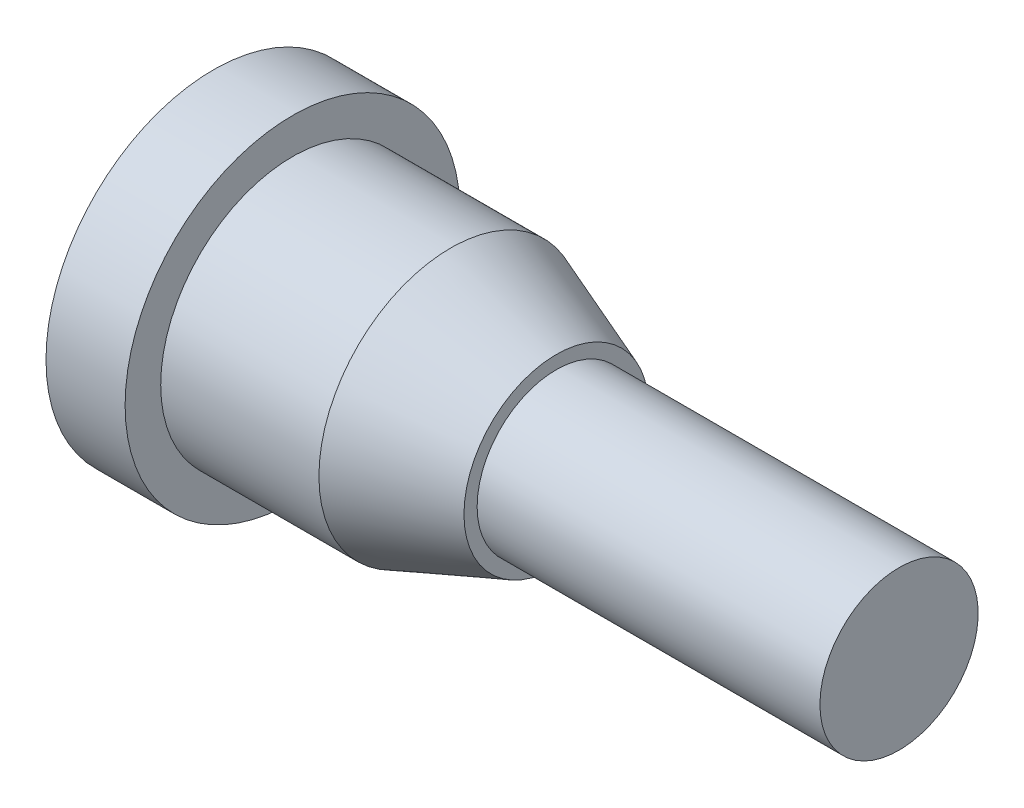
ISO-10303-21;
HEADER;
FILE_DESCRIPTION(('STEP AP214'),'2;1');
FILE_NAME('part.step','',(''),(''),'','','');
FILE_SCHEMA(('AUTOMOTIVE_DESIGN { 1 0 10303 214 1 1 1 1 }'));
ENDSEC;
DATA;
#1=APPLICATION_CONTEXT('core data for automotive mechanical design processes');
#2=APPLICATION_PROTOCOL_DEFINITION('international standard','automotive_design',2000,#1);
#3=PRODUCT_CONTEXT('',#1,'mechanical');
#4=PRODUCT('Part','Part','',(#3));
#5=PRODUCT_RELATED_PRODUCT_CATEGORY('part','',(#4));
#6=PRODUCT_DEFINITION_FORMATION('','',#4);
#7=PRODUCT_DEFINITION_CONTEXT('part definition',#1,'design');
#8=PRODUCT_DEFINITION('design','',#6,#7);
#9=PRODUCT_DEFINITION_SHAPE('','',#8);
#10=(LENGTH_UNIT() NAMED_UNIT(*) SI_UNIT(.MILLI.,.METRE.));
#11=(NAMED_UNIT(*) PLANE_ANGLE_UNIT() SI_UNIT($,.RADIAN.));
#12=(NAMED_UNIT(*) SI_UNIT($,.STERADIAN.) SOLID_ANGLE_UNIT());
#13=UNCERTAINTY_MEASURE_WITH_UNIT(LENGTH_MEASURE(1.E-05),#10,'distance_accuracy_value','');
#14=(GEOMETRIC_REPRESENTATION_CONTEXT(3) GLOBAL_UNCERTAINTY_ASSIGNED_CONTEXT((#13)) GLOBAL_UNIT_ASSIGNED_CONTEXT((#10,
#11,#12)) REPRESENTATION_CONTEXT('',''));
#15=CARTESIAN_POINT('',(0.,0.,0.));
#16=DIRECTION('',(0.,0.,1.));
#17=DIRECTION('',(1.,0.,0.));
#18=AXIS2_PLACEMENT_3D('',#15,#16,#17);
#19=CARTESIAN_POINT('',(0.,0.,0.));
#20=DIRECTION('',(1.,0.,0.));
#21=DIRECTION('',(0.,0.,-1.));
#22=AXIS2_PLACEMENT_3D('',#19,#20,#21);
#23=PLANE('',#22);
#24=CARTESIAN_POINT('',(0.,0.,0.));
#25=DIRECTION('',(-1.,0.,0.));
#26=DIRECTION('',(0.,0.,1.));
#27=AXIS2_PLACEMENT_3D('',#24,#25,#26);
#28=CIRCLE('',#27,6.35);
#29=CARTESIAN_POINT('',(0.,0.,6.35));
#30=VERTEX_POINT('',#29);
#31=EDGE_CURVE('E10',#30,#30,#28,.T.);
#32=ORIENTED_EDGE('',*,*,#31,.T.);
#33=EDGE_LOOP('',(#32));
#34=FACE_BOUND('',#33,.T.);
#35=ADVANCED_FACE('F29',(#34),#23,.F.);
#36=CARTESIAN_POINT('',(-5.03245699579391,0.,0.));
#37=DIRECTION('',(-1.,0.,0.));
#38=DIRECTION('',(0.,0.,1.));
#39=AXIS2_PLACEMENT_3D('',#36,#37,#38);
#40=CYLINDRICAL_SURFACE('',#39,6.35);
#41=ORIENTED_EDGE('',*,*,#31,.F.);
#42=EDGE_LOOP('',(#41));
#43=FACE_BOUND('',#42,.T.);
#44=CARTESIAN_POINT('',(3.,0.,0.));
#45=DIRECTION('',(-1.,0.,0.));
#46=DIRECTION('',(0.,0.,1.));
#47=AXIS2_PLACEMENT_3D('',#44,#45,#46);
#48=CIRCLE('',#47,6.35);
#49=CARTESIAN_POINT('',(3.,0.,6.35));
#50=VERTEX_POINT('',#49);
#51=EDGE_CURVE('E35',#50,#50,#48,.T.);
#52=ORIENTED_EDGE('',*,*,#51,.T.);
#53=EDGE_LOOP('',(#52));
#54=FACE_BOUND('',#53,.T.);
#55=ADVANCED_FACE('F70',(#43,#54),#40,.T.);
#56=CARTESIAN_POINT('',(3.,6.35,0.));
#57=DIRECTION('',(-1.,0.,0.));
#58=DIRECTION('',(0.,0.,1.));
#59=AXIS2_PLACEMENT_3D('',#56,#57,#58);
#60=PLANE('',#59);
#61=ORIENTED_EDGE('',*,*,#51,.F.);
#62=EDGE_LOOP('',(#61));
#63=FACE_BOUND('',#62,.T.);
#64=CARTESIAN_POINT('',(3.,0.,0.));
#65=DIRECTION('',(-1.,0.,0.));
#66=DIRECTION('',(0.,0.,1.));
#67=AXIS2_PLACEMENT_3D('',#64,#65,#66);
#68=CIRCLE('',#67,5.);
#69=CARTESIAN_POINT('',(3.,0.,5.));
#70=VERTEX_POINT('',#69);
#71=EDGE_CURVE('E39',#70,#70,#68,.T.);
#72=ORIENTED_EDGE('',*,*,#71,.T.);
#73=EDGE_LOOP('',(#72));
#74=FACE_BOUND('',#73,.T.);
#75=ADVANCED_FACE('F74',(#63,#74),#60,.F.);
#76=CARTESIAN_POINT('',(-5.03245699579391,0.,0.));
#77=DIRECTION('',(-1.,0.,0.));
#78=DIRECTION('',(0.,0.,1.));
#79=AXIS2_PLACEMENT_3D('',#76,#77,#78);
#80=CYLINDRICAL_SURFACE('',#79,5.);
#81=ORIENTED_EDGE('',*,*,#71,.F.);
#82=EDGE_LOOP('',(#81));
#83=FACE_BOUND('',#82,.T.);
#84=CARTESIAN_POINT('',(9.,0.,0.));
#85=DIRECTION('',(-1.,0.,0.));
#86=DIRECTION('',(0.,0.,1.));
#87=AXIS2_PLACEMENT_3D('',#84,#85,#86);
#88=CIRCLE('',#87,5.);
#89=CARTESIAN_POINT('',(9.,0.,5.));
#90=VERTEX_POINT('',#89);
#91=EDGE_CURVE('E43',#90,#90,#88,.T.);
#92=ORIENTED_EDGE('',*,*,#91,.T.);
#93=EDGE_LOOP('',(#92));
#94=FACE_BOUND('',#93,.T.);
#95=ADVANCED_FACE('F79',(#83,#94),#80,.T.);
#96=CARTESIAN_POINT('',(13.,0.,0.));
#97=DIRECTION('',(-1.,0.,0.));
#98=DIRECTION('',(0.,0.,1.));
#99=AXIS2_PLACEMENT_3D('',#96,#97,#98);
#100=CONICAL_SURFACE('',#99,3.5,0.358770670270572);
#101=ORIENTED_EDGE('',*,*,#91,.F.);
#102=EDGE_LOOP('',(#101));
#103=FACE_BOUND('',#102,.T.);
#104=CARTESIAN_POINT('',(13.,0.,0.));
#105=DIRECTION('',(-1.,0.,0.));
#106=DIRECTION('',(0.,0.,1.));
#107=AXIS2_PLACEMENT_3D('',#104,#105,#106);
#108=CIRCLE('',#107,3.5);
#109=CARTESIAN_POINT('',(13.,0.,3.5));
#110=VERTEX_POINT('',#109);
#111=EDGE_CURVE('E48',#110,#110,#108,.T.);
#112=ORIENTED_EDGE('',*,*,#111,.T.);
#113=EDGE_LOOP('',(#112));
#114=FACE_BOUND('',#113,.T.);
#115=ADVANCED_FACE('F85',(#103,#114),#100,.T.);
#116=CARTESIAN_POINT('',(13.,3.5,0.));
#117=DIRECTION('',(-1.,0.,0.));
#118=DIRECTION('',(0.,0.,1.));
#119=AXIS2_PLACEMENT_3D('',#116,#117,#118);
#120=PLANE('',#119);
#121=ORIENTED_EDGE('',*,*,#111,.F.);
#122=EDGE_LOOP('',(#121));
#123=FACE_BOUND('',#122,.T.);
#124=CARTESIAN_POINT('',(13.,0.,0.));
#125=DIRECTION('',(-1.,0.,0.));
#126=DIRECTION('',(0.,0.,1.));
#127=AXIS2_PLACEMENT_3D('',#124,#125,#126);
#128=CIRCLE('',#127,3.);
#129=CARTESIAN_POINT('',(13.,0.,3.));
#130=VERTEX_POINT('',#129);
#131=EDGE_CURVE('E51',#130,#130,#128,.T.);
#132=ORIENTED_EDGE('',*,*,#131,.T.);
#133=EDGE_LOOP('',(#132));
#134=FACE_BOUND('',#133,.T.);
#135=ADVANCED_FACE('F66',(#123,#134),#120,.F.);
#136=CARTESIAN_POINT('',(-5.03245699579391,0.,0.));
#137=DIRECTION('',(-1.,0.,0.));
#138=DIRECTION('',(0.,0.,1.));
#139=AXIS2_PLACEMENT_3D('',#136,#137,#138);
#140=CYLINDRICAL_SURFACE('',#139,3.);
#141=ORIENTED_EDGE('',*,*,#131,.F.);
#142=EDGE_LOOP('',(#141));
#143=FACE_BOUND('',#142,.T.);
#144=CARTESIAN_POINT('',(26.,0.,0.));
#145=DIRECTION('',(-1.,0.,0.));
#146=DIRECTION('',(0.,0.,1.));
#147=AXIS2_PLACEMENT_3D('',#144,#145,#146);
#148=CIRCLE('',#147,3.);
#149=CARTESIAN_POINT('',(26.,0.,3.));
#150=VERTEX_POINT('',#149);
#151=EDGE_CURVE('E54',#150,#150,#148,.T.);
#152=ORIENTED_EDGE('',*,*,#151,.T.);
#153=EDGE_LOOP('',(#152));
#154=FACE_BOUND('',#153,.T.);
#155=ADVANCED_FACE('F58',(#143,#154),#140,.T.);
#156=CARTESIAN_POINT('',(26.,3.,0.));
#157=DIRECTION('',(-1.,0.,0.));
#158=DIRECTION('',(0.,0.,1.));
#159=AXIS2_PLACEMENT_3D('',#156,#157,#158);
#160=PLANE('',#159);
#161=ORIENTED_EDGE('',*,*,#151,.F.);
#162=EDGE_LOOP('',(#161));
#163=FACE_BOUND('',#162,.T.);
#164=ADVANCED_FACE('F60',(#163),#160,.F.);
#165=CLOSED_SHELL('',(#35,#55,#75,#95,#115,#135,#155,#164));
#166=MANIFOLD_SOLID_BREP('B2',#165);
#167=ADVANCED_BREP_SHAPE_REPRESENTATION('',(#18,#166),#14);
#168=SHAPE_DEFINITION_REPRESENTATION(#9,#167);
ENDSEC;
END-ISO-10303-21;
